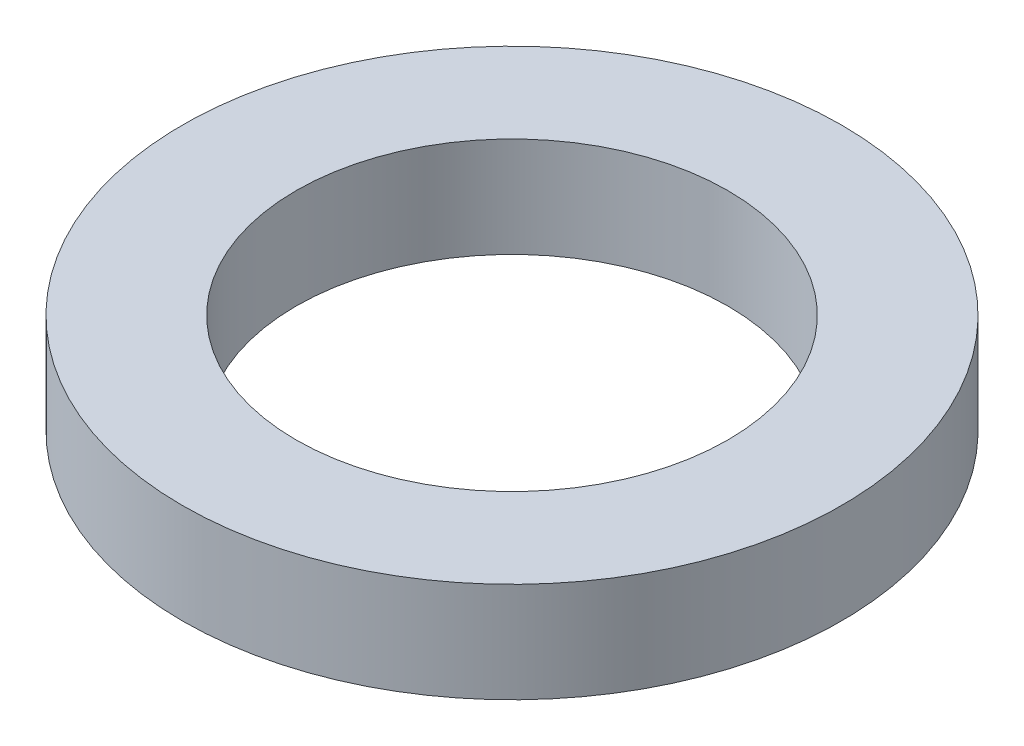
ISO-10303-21;
HEADER;
FILE_DESCRIPTION(('STEP AP214'),'2;1');
FILE_NAME('part.step','',(''),(''),'','','');
FILE_SCHEMA(('AUTOMOTIVE_DESIGN { 1 0 10303 214 1 1 1 1 }'));
ENDSEC;
DATA;
#1=APPLICATION_CONTEXT('core data for automotive mechanical design processes');
#2=APPLICATION_PROTOCOL_DEFINITION('international standard','automotive_design',2000,#1);
#3=PRODUCT_CONTEXT('',#1,'mechanical');
#4=PRODUCT('Part','Part','',(#3));
#5=PRODUCT_RELATED_PRODUCT_CATEGORY('part','',(#4));
#6=PRODUCT_DEFINITION_FORMATION('','',#4);
#7=PRODUCT_DEFINITION_CONTEXT('part definition',#1,'design');
#8=PRODUCT_DEFINITION('design','',#6,#7);
#9=PRODUCT_DEFINITION_SHAPE('','',#8);
#10=(LENGTH_UNIT() NAMED_UNIT(*) SI_UNIT(.MILLI.,.METRE.));
#11=(NAMED_UNIT(*) PLANE_ANGLE_UNIT() SI_UNIT($,.RADIAN.));
#12=(NAMED_UNIT(*) SI_UNIT($,.STERADIAN.) SOLID_ANGLE_UNIT());
#13=UNCERTAINTY_MEASURE_WITH_UNIT(LENGTH_MEASURE(1.E-05),#10,'distance_accuracy_value','');
#14=(GEOMETRIC_REPRESENTATION_CONTEXT(3) GLOBAL_UNCERTAINTY_ASSIGNED_CONTEXT((#13)) GLOBAL_UNIT_ASSIGNED_CONTEXT((#10,
#11,#12)) REPRESENTATION_CONTEXT('',''));
#15=CARTESIAN_POINT('',(0.,0.,0.));
#16=DIRECTION('',(0.,0.,1.));
#17=DIRECTION('',(1.,0.,0.));
#18=AXIS2_PLACEMENT_3D('',#15,#16,#17);
#19=CARTESIAN_POINT('',(0.,22.,0.));
#20=DIRECTION('',(0.,-1.,0.));
#21=DIRECTION('',(0.,0.,-1.));
#22=AXIS2_PLACEMENT_3D('',#19,#20,#21);
#23=CYLINDRICAL_SURFACE('',#22,72.5);
#24=CARTESIAN_POINT('',(0.,22.,0.));
#25=DIRECTION('',(0.,1.,0.));
#26=DIRECTION('',(0.,0.,1.));
#27=AXIS2_PLACEMENT_3D('',#24,#25,#26);
#28=CIRCLE('',#27,72.5);
#29=CARTESIAN_POINT('',(0.,22.,72.5));
#30=VERTEX_POINT('',#29);
#31=EDGE_CURVE('E10',#30,#30,#28,.T.);
#32=ORIENTED_EDGE('',*,*,#31,.F.);
#33=EDGE_LOOP('',(#32));
#34=FACE_BOUND('',#33,.T.);
#35=CARTESIAN_POINT('',(0.,0.,0.));
#36=DIRECTION('',(0.,1.,0.));
#37=DIRECTION('',(0.,0.,1.));
#38=AXIS2_PLACEMENT_3D('',#35,#36,#37);
#39=CIRCLE('',#38,72.5);
#40=CARTESIAN_POINT('',(0.,0.,72.5));
#41=VERTEX_POINT('',#40);
#42=EDGE_CURVE('E37',#41,#41,#39,.T.);
#43=ORIENTED_EDGE('',*,*,#42,.T.);
#44=EDGE_LOOP('',(#43));
#45=FACE_BOUND('',#44,.T.);
#46=ADVANCED_FACE('F40',(#34,#45),#23,.T.);
#47=CARTESIAN_POINT('',(0.,22.,0.));
#48=DIRECTION('',(0.,1.,0.));
#49=DIRECTION('',(0.,0.,1.));
#50=AXIS2_PLACEMENT_3D('',#47,#48,#49);
#51=PLANE('',#50);
#52=CARTESIAN_POINT('',(0.,22.,0.));
#53=DIRECTION('',(0.,1.,0.));
#54=DIRECTION('',(0.,0.,1.));
#55=AXIS2_PLACEMENT_3D('',#52,#53,#54);
#56=CIRCLE('',#55,47.5);
#57=CARTESIAN_POINT('',(0.,22.,47.5));
#58=VERTEX_POINT('',#57);
#59=EDGE_CURVE('E50',#58,#58,#56,.T.);
#60=ORIENTED_EDGE('',*,*,#59,.F.);
#61=EDGE_LOOP('',(#60));
#62=FACE_BOUND('',#61,.T.);
#63=ORIENTED_EDGE('',*,*,#31,.T.);
#64=EDGE_LOOP('',(#63));
#65=FACE_BOUND('',#64,.T.);
#66=ADVANCED_FACE('F59',(#62,#65),#51,.T.);
#67=CARTESIAN_POINT('',(0.,0.,0.));
#68=DIRECTION('',(0.,1.,0.));
#69=DIRECTION('',(0.,0.,1.));
#70=AXIS2_PLACEMENT_3D('',#67,#68,#69);
#71=PLANE('',#70);
#72=CARTESIAN_POINT('',(0.,0.,0.));
#73=DIRECTION('',(0.,1.,0.));
#74=DIRECTION('',(0.,0.,1.));
#75=AXIS2_PLACEMENT_3D('',#72,#73,#74);
#76=CIRCLE('',#75,47.5);
#77=CARTESIAN_POINT('',(0.,0.,47.5));
#78=VERTEX_POINT('',#77);
#79=EDGE_CURVE('E47',#78,#78,#76,.T.);
#80=ORIENTED_EDGE('',*,*,#79,.T.);
#81=EDGE_LOOP('',(#80));
#82=FACE_BOUND('',#81,.T.);
#83=ORIENTED_EDGE('',*,*,#42,.F.);
#84=EDGE_LOOP('',(#83));
#85=FACE_BOUND('',#84,.T.);
#86=ADVANCED_FACE('F58',(#82,#85),#71,.F.);
#87=CARTESIAN_POINT('',(0.,22.,0.));
#88=DIRECTION('',(0.,-1.,0.));
#89=DIRECTION('',(0.,0.,-1.));
#90=AXIS2_PLACEMENT_3D('',#87,#88,#89);
#91=CYLINDRICAL_SURFACE('',#90,47.5);
#92=ORIENTED_EDGE('',*,*,#59,.T.);
#93=EDGE_LOOP('',(#92));
#94=FACE_BOUND('',#93,.T.);
#95=ORIENTED_EDGE('',*,*,#79,.F.);
#96=EDGE_LOOP('',(#95));
#97=FACE_BOUND('',#96,.T.);
#98=ADVANCED_FACE('F54',(#94,#97),#91,.F.);
#99=CLOSED_SHELL('',(#46,#66,#86,#98));
#100=MANIFOLD_SOLID_BREP('B2',#99);
#101=ADVANCED_BREP_SHAPE_REPRESENTATION('',(#18,#100),#14);
#102=SHAPE_DEFINITION_REPRESENTATION(#9,#101);
ENDSEC;
END-ISO-10303-21;
